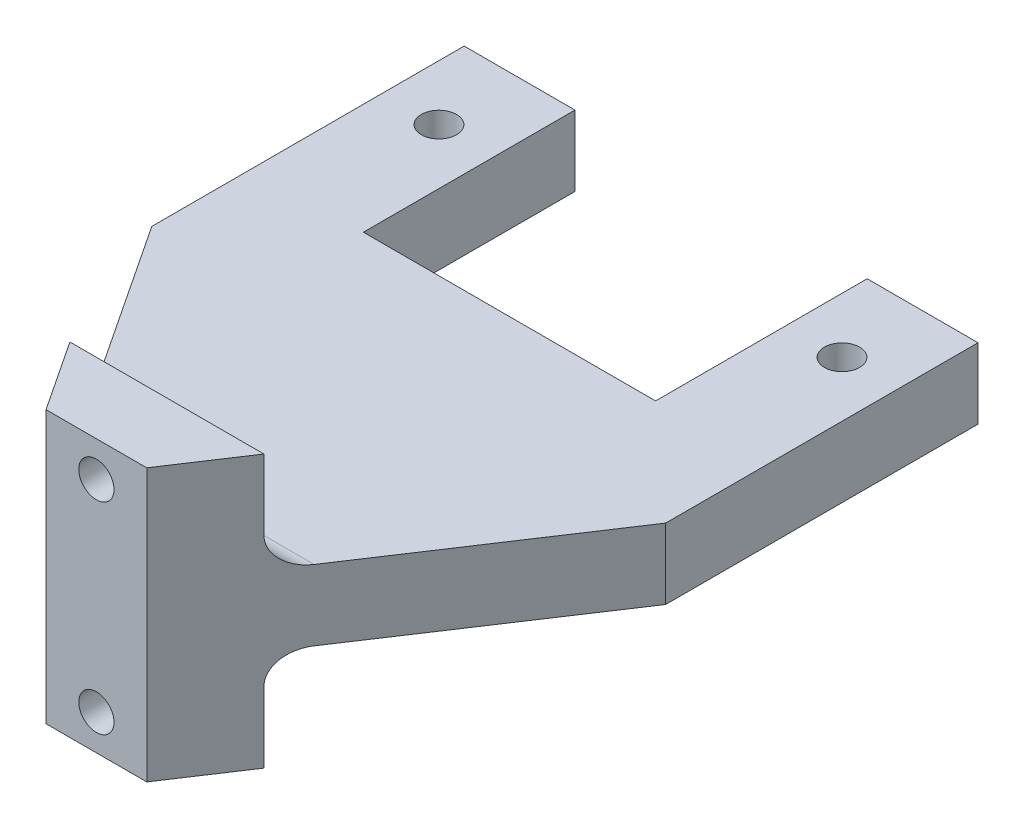
ISO-10303-21;
HEADER;
FILE_DESCRIPTION(('STEP AP214'),'2;1');
FILE_NAME('part.step','',(''),(''),'','','');
FILE_SCHEMA(('AUTOMOTIVE_DESIGN { 1 0 10303 214 1 1 1 1 }'));
ENDSEC;
DATA;
#1=APPLICATION_CONTEXT('core data for automotive mechanical design processes');
#2=APPLICATION_PROTOCOL_DEFINITION('international standard','automotive_design',2000,#1);
#3=PRODUCT_CONTEXT('',#1,'mechanical');
#4=PRODUCT('Part','Part','',(#3));
#5=PRODUCT_RELATED_PRODUCT_CATEGORY('part','',(#4));
#6=PRODUCT_DEFINITION_FORMATION('','',#4);
#7=PRODUCT_DEFINITION_CONTEXT('part definition',#1,'design');
#8=PRODUCT_DEFINITION('design','',#6,#7);
#9=PRODUCT_DEFINITION_SHAPE('','',#8);
#10=(LENGTH_UNIT() NAMED_UNIT(*) SI_UNIT(.MILLI.,.METRE.));
#11=(NAMED_UNIT(*) PLANE_ANGLE_UNIT() SI_UNIT($,.RADIAN.));
#12=(NAMED_UNIT(*) SI_UNIT($,.STERADIAN.) SOLID_ANGLE_UNIT());
#13=UNCERTAINTY_MEASURE_WITH_UNIT(LENGTH_MEASURE(1.E-05),#10,'distance_accuracy_value','');
#14=(GEOMETRIC_REPRESENTATION_CONTEXT(3) GLOBAL_UNCERTAINTY_ASSIGNED_CONTEXT((#13)) GLOBAL_UNIT_ASSIGNED_CONTEXT((#10,
#11,#12)) REPRESENTATION_CONTEXT('',''));
#15=CARTESIAN_POINT('',(0.,0.,0.));
#16=DIRECTION('',(0.,0.,1.));
#17=DIRECTION('',(1.,0.,0.));
#18=AXIS2_PLACEMENT_3D('',#15,#16,#17);
#19=CARTESIAN_POINT('',(0.,0.,0.));
#20=DIRECTION('',(0.,-1.,0.));
#21=DIRECTION('',(0.,0.,-1.));
#22=AXIS2_PLACEMENT_3D('',#19,#20,#21);
#23=PLANE('',#22);
#24=CARTESIAN_POINT('',(5.5,0.,-54.));
#25=DIRECTION('',(0.,1.,0.));
#26=DIRECTION('',(0.,0.,1.));
#27=AXIS2_PLACEMENT_3D('',#24,#25,#26);
#28=CIRCLE('',#27,1.75);
#29=CARTESIAN_POINT('',(5.5,0.,-52.25));
#30=VERTEX_POINT('',#29);
#31=EDGE_CURVE('E238',#30,#30,#28,.T.);
#32=ORIENTED_EDGE('',*,*,#31,.T.);
#33=EDGE_LOOP('',(#32));
#34=FACE_BOUND('',#33,.T.);
#35=CARTESIAN_POINT('',(45.5,0.,-54.));
#36=DIRECTION('',(0.,1.,0.));
#37=DIRECTION('',(0.,0.,1.));
#38=AXIS2_PLACEMENT_3D('',#35,#36,#37);
#39=CIRCLE('',#38,1.75);
#40=CARTESIAN_POINT('',(45.5,0.,-52.25));
#41=VERTEX_POINT('',#40);
#42=EDGE_CURVE('E247',#41,#41,#39,.T.);
#43=ORIENTED_EDGE('',*,*,#42,.T.);
#44=EDGE_LOOP('',(#43));
#45=FACE_BOUND('',#44,.T.);
#46=DIRECTION('',(-0.551591691076976,0.,0.834114264555428));
#47=VECTOR('',#46,1.);
#48=CARTESIAN_POINT('',(30.5,0.,0.));
#49=LINE('',#48,#47);
#50=CARTESIAN_POINT('',(51.,0.,-31.));
#51=VERTEX_POINT('',#50);
#52=CARTESIAN_POINT('',(37.1129032258065,0.,-10.));
#53=VERTEX_POINT('',#52);
#54=EDGE_CURVE('E230',#51,#53,#49,.T.);
#55=ORIENTED_EDGE('',*,*,#54,.T.);
#56=DIRECTION('',(-1.,0.,0.));
#57=VECTOR('',#56,1.);
#58=CARTESIAN_POINT('',(15.8709677419355,0.,-10.));
#59=LINE('',#58,#57);
#60=CARTESIAN_POINT('',(13.8870967741935,0.,-10.));
#61=VERTEX_POINT('',#60);
#62=EDGE_CURVE('E321',#53,#61,#59,.T.);
#63=ORIENTED_EDGE('',*,*,#62,.T.);
#64=DIRECTION('',(-0.551591691076976,0.,-0.834114264555427));
#65=VECTOR('',#64,1.);
#66=CARTESIAN_POINT('',(20.5,0.,0.));
#67=LINE('',#66,#65);
#68=CARTESIAN_POINT('',(0.,0.,-31.));
#69=VERTEX_POINT('',#68);
#70=EDGE_CURVE('E218',#61,#69,#67,.T.);
#71=ORIENTED_EDGE('',*,*,#70,.T.);
#72=DIRECTION('',(0.,0.,1.));
#73=VECTOR('',#72,1.);
#74=CARTESIAN_POINT('',(0.,0.,0.));
#75=LINE('',#74,#73);
#76=CARTESIAN_POINT('',(0.,0.,-62.));
#77=VERTEX_POINT('',#76);
#78=EDGE_CURVE('E280',#77,#69,#75,.T.);
#79=ORIENTED_EDGE('',*,*,#78,.F.);
#80=DIRECTION('',(-1.,0.,0.));
#81=VECTOR('',#80,1.);
#82=CARTESIAN_POINT('',(0.,0.,-62.));
#83=LINE('',#82,#81);
#84=CARTESIAN_POINT('',(11.,0.,-62.));
#85=VERTEX_POINT('',#84);
#86=EDGE_CURVE('E310',#85,#77,#83,.T.);
#87=ORIENTED_EDGE('',*,*,#86,.F.);
#88=DIRECTION('',(0.,0.,1.));
#89=VECTOR('',#88,1.);
#90=CARTESIAN_POINT('',(11.,0.,-62.));
#91=LINE('',#90,#89);
#92=CARTESIAN_POINT('',(11.,0.,-41.));
#93=VERTEX_POINT('',#92);
#94=EDGE_CURVE('E263',#85,#93,#91,.T.);
#95=ORIENTED_EDGE('',*,*,#94,.T.);
#96=DIRECTION('',(1.,0.,0.));
#97=VECTOR('',#96,1.);
#98=CARTESIAN_POINT('',(11.,0.,-41.));
#99=LINE('',#98,#97);
#100=CARTESIAN_POINT('',(40.,0.,-41.));
#101=VERTEX_POINT('',#100);
#102=EDGE_CURVE('E254',#93,#101,#99,.T.);
#103=ORIENTED_EDGE('',*,*,#102,.T.);
#104=DIRECTION('',(0.,0.,-1.));
#105=VECTOR('',#104,1.);
#106=CARTESIAN_POINT('',(40.,0.,-62.));
#107=LINE('',#106,#105);
#108=CARTESIAN_POINT('',(40.,0.,-62.));
#109=VERTEX_POINT('',#108);
#110=EDGE_CURVE('E258',#101,#109,#107,.T.);
#111=ORIENTED_EDGE('',*,*,#110,.T.);
#112=CARTESIAN_POINT('',(51.,0.,-62.));
#113=VERTEX_POINT('',#112);
#114=EDGE_CURVE('E295',#113,#109,#83,.T.);
#115=ORIENTED_EDGE('',*,*,#114,.F.);
#116=DIRECTION('',(0.,0.,-1.));
#117=VECTOR('',#116,1.);
#118=CARTESIAN_POINT('',(51.,0.,0.));
#119=LINE('',#118,#117);
#120=EDGE_CURVE('E307',#51,#113,#119,.T.);
#121=ORIENTED_EDGE('',*,*,#120,.F.);
#122=EDGE_LOOP('',(#55,#63,#71,#79,#87,#95,#103,#111,#115,#121));
#123=FACE_BOUND('',#122,.T.);
#124=ADVANCED_FACE('F39',(#34,#45,#123),#23,.T.);
#125=CARTESIAN_POINT('',(0.,7.,0.));
#126=DIRECTION('',(0.,-1.,0.));
#127=DIRECTION('',(0.,0.,-1.));
#128=AXIS2_PLACEMENT_3D('',#125,#126,#127);
#129=PLANE('',#128);
#130=CARTESIAN_POINT('',(45.5,7.,-54.));
#131=DIRECTION('',(0.,1.,0.));
#132=DIRECTION('',(0.,0.,1.));
#133=AXIS2_PLACEMENT_3D('',#130,#131,#132);
#134=CIRCLE('',#133,1.75);
#135=CARTESIAN_POINT('',(45.5,7.,-52.25));
#136=VERTEX_POINT('',#135);
#137=EDGE_CURVE('E227',#136,#136,#134,.T.);
#138=ORIENTED_EDGE('',*,*,#137,.F.);
#139=EDGE_LOOP('',(#138));
#140=FACE_BOUND('',#139,.T.);
#141=CARTESIAN_POINT('',(5.5,7.,-54.));
#142=DIRECTION('',(0.,1.,0.));
#143=DIRECTION('',(0.,0.,1.));
#144=AXIS2_PLACEMENT_3D('',#141,#142,#143);
#145=CIRCLE('',#144,1.75);
#146=CARTESIAN_POINT('',(5.5,7.,-52.25));
#147=VERTEX_POINT('',#146);
#148=EDGE_CURVE('E243',#147,#147,#145,.T.);
#149=ORIENTED_EDGE('',*,*,#148,.F.);
#150=EDGE_LOOP('',(#149));
#151=FACE_BOUND('',#150,.T.);
#152=DIRECTION('',(-0.551591691076976,0.,-0.834114264555427));
#153=VECTOR('',#152,1.);
#154=CARTESIAN_POINT('',(20.5,7.,0.));
#155=LINE('',#154,#153);
#156=CARTESIAN_POINT('',(13.8870967741935,7.,-10.));
#157=VERTEX_POINT('',#156);
#158=CARTESIAN_POINT('',(0.,7.,-31.));
#159=VERTEX_POINT('',#158);
#160=EDGE_CURVE('E166',#157,#159,#155,.T.);
#161=ORIENTED_EDGE('',*,*,#160,.F.);
#162=DIRECTION('',(-1.,0.,0.));
#163=VECTOR('',#162,1.);
#164=CARTESIAN_POINT('',(35.1290322580645,7.,-10.));
#165=LINE('',#164,#163);
#166=CARTESIAN_POINT('',(37.1129032258065,7.,-10.));
#167=VERTEX_POINT('',#166);
#168=EDGE_CURVE('E61',#157,#167,#165,.F.);
#169=ORIENTED_EDGE('',*,*,#168,.T.);
#170=DIRECTION('',(-0.551591691076976,0.,0.834114264555428));
#171=VECTOR('',#170,1.);
#172=CARTESIAN_POINT('',(30.5,7.,0.));
#173=LINE('',#172,#171);
#174=CARTESIAN_POINT('',(51.,7.,-31.));
#175=VERTEX_POINT('',#174);
#176=EDGE_CURVE('E217',#175,#167,#173,.T.);
#177=ORIENTED_EDGE('',*,*,#176,.F.);
#178=DIRECTION('',(0.,0.,-1.));
#179=VECTOR('',#178,1.);
#180=CARTESIAN_POINT('',(51.,7.,0.));
#181=LINE('',#180,#179);
#182=CARTESIAN_POINT('',(51.,7.,-62.));
#183=VERTEX_POINT('',#182);
#184=EDGE_CURVE('E294',#175,#183,#181,.T.);
#185=ORIENTED_EDGE('',*,*,#184,.T.);
#186=DIRECTION('',(-1.,0.,0.));
#187=VECTOR('',#186,1.);
#188=CARTESIAN_POINT('',(0.,7.,-62.));
#189=LINE('',#188,#187);
#190=CARTESIAN_POINT('',(40.,7.,-62.));
#191=VERTEX_POINT('',#190);
#192=EDGE_CURVE('E299',#183,#191,#189,.T.);
#193=ORIENTED_EDGE('',*,*,#192,.T.);
#194=DIRECTION('',(0.,0.,-1.));
#195=VECTOR('',#194,1.);
#196=CARTESIAN_POINT('',(40.,7.,-62.));
#197=LINE('',#196,#195);
#198=CARTESIAN_POINT('',(40.,7.,-41.));
#199=VERTEX_POINT('',#198);
#200=EDGE_CURVE('E271',#199,#191,#197,.T.);
#201=ORIENTED_EDGE('',*,*,#200,.F.);
#202=DIRECTION('',(1.,0.,0.));
#203=VECTOR('',#202,1.);
#204=CARTESIAN_POINT('',(11.,7.,-41.));
#205=LINE('',#204,#203);
#206=CARTESIAN_POINT('',(11.,7.,-41.));
#207=VERTEX_POINT('',#206);
#208=EDGE_CURVE('E242',#207,#199,#205,.T.);
#209=ORIENTED_EDGE('',*,*,#208,.F.);
#210=DIRECTION('',(0.,0.,1.));
#211=VECTOR('',#210,1.);
#212=CARTESIAN_POINT('',(11.,7.,-62.));
#213=LINE('',#212,#211);
#214=CARTESIAN_POINT('',(11.,7.,-62.));
#215=VERTEX_POINT('',#214);
#216=EDGE_CURVE('E259',#215,#207,#213,.T.);
#217=ORIENTED_EDGE('',*,*,#216,.F.);
#218=CARTESIAN_POINT('',(0.,7.,-62.));
#219=VERTEX_POINT('',#218);
#220=EDGE_CURVE('E298',#215,#219,#189,.T.);
#221=ORIENTED_EDGE('',*,*,#220,.T.);
#222=DIRECTION('',(0.,0.,1.));
#223=VECTOR('',#222,1.);
#224=CARTESIAN_POINT('',(0.,7.,0.));
#225=LINE('',#224,#223);
#226=EDGE_CURVE('E290',#219,#159,#225,.T.);
#227=ORIENTED_EDGE('',*,*,#226,.T.);
#228=EDGE_LOOP('',(#161,#169,#177,#185,#193,#201,#209,#217,#221,#227));
#229=FACE_BOUND('',#228,.T.);
#230=ADVANCED_FACE('F365',(#140,#151,#229),#129,.F.);
#231=CARTESIAN_POINT('',(0.,7.,-62.));
#232=DIRECTION('',(0.,0.,1.));
#233=DIRECTION('',(1.,0.,0.));
#234=AXIS2_PLACEMENT_3D('',#231,#232,#233);
#235=PLANE('',#234);
#236=ORIENTED_EDGE('',*,*,#220,.F.);
#237=DIRECTION('',(0.,1.,0.));
#238=VECTOR('',#237,1.);
#239=CARTESIAN_POINT('',(11.,0.,-62.));
#240=LINE('',#239,#238);
#241=EDGE_CURVE('E281',#85,#215,#240,.T.);
#242=ORIENTED_EDGE('',*,*,#241,.F.);
#243=ORIENTED_EDGE('',*,*,#86,.T.);
#244=DIRECTION('',(0.,-1.,0.));
#245=VECTOR('',#244,1.);
#246=CARTESIAN_POINT('',(0.,7.,-62.));
#247=LINE('',#246,#245);
#248=EDGE_CURVE('E303',#219,#77,#247,.T.);
#249=ORIENTED_EDGE('',*,*,#248,.F.);
#250=EDGE_LOOP('',(#236,#242,#243,#249));
#251=FACE_BOUND('',#250,.T.);
#252=ADVANCED_FACE('F355',(#251),#235,.F.);
#253=CARTESIAN_POINT('',(0.,7.,0.));
#254=DIRECTION('',(1.,0.,0.));
#255=DIRECTION('',(0.,0.,-1.));
#256=AXIS2_PLACEMENT_3D('',#253,#254,#255);
#257=PLANE('',#256);
#258=ORIENTED_EDGE('',*,*,#78,.T.);
#259=DIRECTION('',(0.,1.,0.));
#260=VECTOR('',#259,1.);
#261=CARTESIAN_POINT('',(0.,0.,-31.));
#262=LINE('',#261,#260);
#263=EDGE_CURVE('E223',#69,#159,#262,.T.);
#264=ORIENTED_EDGE('',*,*,#263,.T.);
#265=ORIENTED_EDGE('',*,*,#226,.F.);
#266=ORIENTED_EDGE('',*,*,#248,.T.);
#267=EDGE_LOOP('',(#258,#264,#265,#266));
#268=FACE_BOUND('',#267,.T.);
#269=ADVANCED_FACE('F360',(#268),#257,.F.);
#270=CARTESIAN_POINT('',(0.,7.,0.));
#271=DIRECTION('',(0.,0.,-1.));
#272=DIRECTION('',(-1.,0.,0.));
#273=AXIS2_PLACEMENT_3D('',#270,#271,#272);
#274=PLANE('',#273);
#275=CARTESIAN_POINT('',(25.5,13.5,0.));
#276=DIRECTION('',(0.,0.,1.));
#277=DIRECTION('',(1.,0.,0.));
#278=AXIS2_PLACEMENT_3D('',#275,#276,#277);
#279=CIRCLE('',#278,1.75);
#280=CARTESIAN_POINT('',(27.25,13.5,0.));
#281=VERTEX_POINT('',#280);
#282=EDGE_CURVE('E326',#281,#281,#279,.T.);
#283=ORIENTED_EDGE('',*,*,#282,.F.);
#284=EDGE_LOOP('',(#283));
#285=FACE_BOUND('',#284,.T.);
#286=CARTESIAN_POINT('',(25.5,-6.5,0.));
#287=DIRECTION('',(0.,0.,1.));
#288=DIRECTION('',(1.,0.,0.));
#289=AXIS2_PLACEMENT_3D('',#286,#287,#288);
#290=CIRCLE('',#289,1.75);
#291=CARTESIAN_POINT('',(27.25,-6.5,0.));
#292=VERTEX_POINT('',#291);
#293=EDGE_CURVE('E620',#292,#292,#290,.T.);
#294=ORIENTED_EDGE('',*,*,#293,.F.);
#295=EDGE_LOOP('',(#294));
#296=FACE_BOUND('',#295,.T.);
#297=DIRECTION('',(0.,1.,0.));
#298=VECTOR('',#297,1.);
#299=CARTESIAN_POINT('',(30.5,0.,0.));
#300=LINE('',#299,#298);
#301=CARTESIAN_POINT('',(30.5,-10.,0.));
#302=VERTEX_POINT('',#301);
#303=CARTESIAN_POINT('',(30.5,17.,0.));
#304=VERTEX_POINT('',#303);
#305=EDGE_CURVE('E152',#302,#304,#300,.T.);
#306=ORIENTED_EDGE('',*,*,#305,.T.);
#307=DIRECTION('',(1.,0.,0.));
#308=VECTOR('',#307,1.);
#309=CARTESIAN_POINT('',(30.5,17.,0.));
#310=LINE('',#309,#308);
#311=CARTESIAN_POINT('',(20.5,17.,0.));
#312=VERTEX_POINT('',#311);
#313=EDGE_CURVE('E207',#312,#304,#310,.T.);
#314=ORIENTED_EDGE('',*,*,#313,.F.);
#315=DIRECTION('',(0.,1.,0.));
#316=VECTOR('',#315,1.);
#317=CARTESIAN_POINT('',(20.5,0.,0.));
#318=LINE('',#317,#316);
#319=CARTESIAN_POINT('',(20.5,-10.,0.));
#320=VERTEX_POINT('',#319);
#321=EDGE_CURVE('E181',#320,#312,#318,.T.);
#322=ORIENTED_EDGE('',*,*,#321,.F.);
#323=DIRECTION('',(1.,0.,0.));
#324=VECTOR('',#323,1.);
#325=CARTESIAN_POINT('',(30.5,-10.,0.));
#326=LINE('',#325,#324);
#327=EDGE_CURVE('E173',#320,#302,#326,.T.);
#328=ORIENTED_EDGE('',*,*,#327,.T.);
#329=EDGE_LOOP('',(#306,#314,#322,#328));
#330=FACE_BOUND('',#329,.T.);
#331=ADVANCED_FACE('F180',(#285,#296,#330),#274,.F.);
#332=CARTESIAN_POINT('',(51.,7.,0.));
#333=DIRECTION('',(-1.,0.,0.));
#334=DIRECTION('',(0.,0.,1.));
#335=AXIS2_PLACEMENT_3D('',#332,#333,#334);
#336=PLANE('',#335);
#337=ORIENTED_EDGE('',*,*,#184,.F.);
#338=DIRECTION('',(0.,1.,0.));
#339=VECTOR('',#338,1.);
#340=CARTESIAN_POINT('',(51.,0.,-31.));
#341=LINE('',#340,#339);
#342=EDGE_CURVE('E167',#51,#175,#341,.T.);
#343=ORIENTED_EDGE('',*,*,#342,.F.);
#344=ORIENTED_EDGE('',*,*,#120,.T.);
#345=DIRECTION('',(0.,-1.,0.));
#346=VECTOR('',#345,1.);
#347=CARTESIAN_POINT('',(51.,7.,-62.));
#348=LINE('',#347,#346);
#349=EDGE_CURVE('E317',#183,#113,#348,.T.);
#350=ORIENTED_EDGE('',*,*,#349,.F.);
#351=EDGE_LOOP('',(#337,#343,#344,#350));
#352=FACE_BOUND('',#351,.T.);
#353=ADVANCED_FACE('F385',(#352),#336,.F.);
#354=ORIENTED_EDGE('',*,*,#114,.T.);
#355=DIRECTION('',(0.,1.,0.));
#356=VECTOR('',#355,1.);
#357=CARTESIAN_POINT('',(40.,0.,-62.));
#358=LINE('',#357,#356);
#359=EDGE_CURVE('E284',#109,#191,#358,.T.);
#360=ORIENTED_EDGE('',*,*,#359,.T.);
#361=ORIENTED_EDGE('',*,*,#192,.F.);
#362=ORIENTED_EDGE('',*,*,#349,.T.);
#363=EDGE_LOOP('',(#354,#360,#361,#362));
#364=FACE_BOUND('',#363,.T.);
#365=ADVANCED_FACE('F380',(#364),#235,.F.);
#366=CARTESIAN_POINT('',(11.,0.,-41.));
#367=DIRECTION('',(0.,0.,1.));
#368=DIRECTION('',(1.,0.,0.));
#369=AXIS2_PLACEMENT_3D('',#366,#367,#368);
#370=PLANE('',#369);
#371=ORIENTED_EDGE('',*,*,#208,.T.);
#372=DIRECTION('',(0.,1.,0.));
#373=VECTOR('',#372,1.);
#374=CARTESIAN_POINT('',(40.,0.,-41.));
#375=LINE('',#374,#373);
#376=EDGE_CURVE('E267',#101,#199,#375,.T.);
#377=ORIENTED_EDGE('',*,*,#376,.F.);
#378=ORIENTED_EDGE('',*,*,#102,.F.);
#379=DIRECTION('',(0.,1.,0.));
#380=VECTOR('',#379,1.);
#381=CARTESIAN_POINT('',(11.,0.,-41.));
#382=LINE('',#381,#380);
#383=EDGE_CURVE('E277',#93,#207,#382,.T.);
#384=ORIENTED_EDGE('',*,*,#383,.T.);
#385=EDGE_LOOP('',(#371,#377,#378,#384));
#386=FACE_BOUND('',#385,.T.);
#387=ADVANCED_FACE('F375',(#386),#370,.F.);
#388=CARTESIAN_POINT('',(11.,0.,-62.));
#389=DIRECTION('',(-1.,0.,0.));
#390=DIRECTION('',(0.,0.,1.));
#391=AXIS2_PLACEMENT_3D('',#388,#389,#390);
#392=PLANE('',#391);
#393=ORIENTED_EDGE('',*,*,#216,.T.);
#394=ORIENTED_EDGE('',*,*,#383,.F.);
#395=ORIENTED_EDGE('',*,*,#94,.F.);
#396=ORIENTED_EDGE('',*,*,#241,.T.);
#397=EDGE_LOOP('',(#393,#394,#395,#396));
#398=FACE_BOUND('',#397,.T.);
#399=ADVANCED_FACE('F370',(#398),#392,.F.);
#400=CARTESIAN_POINT('',(40.,0.,-62.));
#401=DIRECTION('',(1.,0.,0.));
#402=DIRECTION('',(0.,0.,-1.));
#403=AXIS2_PLACEMENT_3D('',#400,#401,#402);
#404=PLANE('',#403);
#405=ORIENTED_EDGE('',*,*,#200,.T.);
#406=ORIENTED_EDGE('',*,*,#359,.F.);
#407=ORIENTED_EDGE('',*,*,#110,.F.);
#408=ORIENTED_EDGE('',*,*,#376,.T.);
#409=EDGE_LOOP('',(#405,#406,#407,#408));
#410=FACE_BOUND('',#409,.T.);
#411=ADVANCED_FACE('F377',(#410),#404,.F.);
#412=CARTESIAN_POINT('',(45.5,0.,-54.));
#413=DIRECTION('',(0.,1.,0.));
#414=DIRECTION('',(0.,0.,1.));
#415=AXIS2_PLACEMENT_3D('',#412,#413,#414);
#416=CYLINDRICAL_SURFACE('',#415,1.75);
#417=ORIENTED_EDGE('',*,*,#42,.F.);
#418=EDGE_LOOP('',(#417));
#419=FACE_BOUND('',#418,.T.);
#420=ORIENTED_EDGE('',*,*,#137,.T.);
#421=EDGE_LOOP('',(#420));
#422=FACE_BOUND('',#421,.T.);
#423=ADVANCED_FACE('F462',(#419,#422),#416,.F.);
#424=CARTESIAN_POINT('',(5.5,0.,-54.));
#425=DIRECTION('',(0.,1.,0.));
#426=DIRECTION('',(0.,0.,1.));
#427=AXIS2_PLACEMENT_3D('',#424,#425,#426);
#428=CYLINDRICAL_SURFACE('',#427,1.75);
#429=ORIENTED_EDGE('',*,*,#31,.F.);
#430=EDGE_LOOP('',(#429));
#431=FACE_BOUND('',#430,.T.);
#432=ORIENTED_EDGE('',*,*,#148,.T.);
#433=EDGE_LOOP('',(#432));
#434=FACE_BOUND('',#433,.T.);
#435=ADVANCED_FACE('F459',(#431,#434),#428,.F.);
#436=CARTESIAN_POINT('',(30.5,0.,0.));
#437=DIRECTION('',(-0.834114264555428,0.,-0.551591691076976));
#438=DIRECTION('',(-0.551591691076976,0.,0.834114264555428));
#439=AXIS2_PLACEMENT_3D('',#436,#437,#438);
#440=PLANE('',#439);
#441=ORIENTED_EDGE('',*,*,#176,.T.);
#442=CARTESIAN_POINT('',(37.1129032258065,10.,-10.));
#443=DIRECTION('',(-0.834114264555428,0.,-0.551591691076976));
#444=DIRECTION('',(0.551591691076976,0.,-0.834114264555428));
#445=AXIS2_PLACEMENT_3D('',#442,#443,#444);
#446=ELLIPSE('',#445,3.59662953564157,3.);
#447=CARTESIAN_POINT('',(35.1290322580645,10.,-7.));
#448=VERTEX_POINT('',#447);
#449=EDGE_CURVE('E11',#167,#448,#446,.T.);
#450=ORIENTED_EDGE('',*,*,#449,.T.);
#451=DIRECTION('',(0.,-1.,0.));
#452=VECTOR('',#451,1.);
#453=CARTESIAN_POINT('',(35.1290322580645,17.,-7.));
#454=LINE('',#453,#452);
#455=CARTESIAN_POINT('',(35.1290322580645,17.,-7.));
#456=VERTEX_POINT('',#455);
#457=EDGE_CURVE('E213',#456,#448,#454,.T.);
#458=ORIENTED_EDGE('',*,*,#457,.F.);
#459=DIRECTION('',(0.551591691076976,0.,-0.834114264555428));
#460=VECTOR('',#459,1.);
#461=CARTESIAN_POINT('',(35.1290322580645,17.,-7.));
#462=LINE('',#461,#460);
#463=EDGE_CURVE('E160',#304,#456,#462,.T.);
#464=ORIENTED_EDGE('',*,*,#463,.F.);
#465=ORIENTED_EDGE('',*,*,#305,.F.);
#466=DIRECTION('',(0.551591691076976,0.,-0.834114264555428));
#467=VECTOR('',#466,1.);
#468=CARTESIAN_POINT('',(35.1290322580645,-10.,-7.));
#469=LINE('',#468,#467);
#470=CARTESIAN_POINT('',(35.1290322580645,-10.,-7.));
#471=VERTEX_POINT('',#470);
#472=EDGE_CURVE('E156',#302,#471,#469,.T.);
#473=ORIENTED_EDGE('',*,*,#472,.T.);
#474=DIRECTION('',(0.,1.,0.));
#475=VECTOR('',#474,1.);
#476=CARTESIAN_POINT('',(35.1290322580645,-10.,-7.));
#477=LINE('',#476,#475);
#478=CARTESIAN_POINT('',(35.1290322580645,-3.,-7.));
#479=VERTEX_POINT('',#478);
#480=EDGE_CURVE('E191',#471,#479,#477,.T.);
#481=ORIENTED_EDGE('',*,*,#480,.T.);
#482=CARTESIAN_POINT('',(37.1129032258065,-3.,-10.));
#483=DIRECTION('',(-0.834114264555428,0.,-0.551591691076976));
#484=DIRECTION('',(0.551591691076976,0.,-0.834114264555428));
#485=AXIS2_PLACEMENT_3D('',#482,#483,#484);
#486=ELLIPSE('',#485,3.59662953564157,3.);
#487=EDGE_CURVE('E345',#479,#53,#486,.T.);
#488=ORIENTED_EDGE('',*,*,#487,.T.);
#489=ORIENTED_EDGE('',*,*,#54,.F.);
#490=ORIENTED_EDGE('',*,*,#342,.T.);
#491=EDGE_LOOP('',(#441,#450,#458,#464,#465,#473,#481,#488,#489,#490));
#492=FACE_BOUND('',#491,.T.);
#493=ADVANCED_FACE('F154',(#492),#440,.F.);
#494=CARTESIAN_POINT('',(20.5,0.,0.));
#495=DIRECTION('',(0.834114264555427,0.,-0.551591691076976));
#496=DIRECTION('',(-0.551591691076976,0.,-0.834114264555427));
#497=AXIS2_PLACEMENT_3D('',#494,#495,#496);
#498=PLANE('',#497);
#499=ORIENTED_EDGE('',*,*,#321,.T.);
#500=DIRECTION('',(0.551591691076976,0.,0.834114264555427));
#501=VECTOR('',#500,1.);
#502=CARTESIAN_POINT('',(20.5,17.,0.));
#503=LINE('',#502,#501);
#504=CARTESIAN_POINT('',(15.8709677419355,17.,-7.));
#505=VERTEX_POINT('',#504);
#506=EDGE_CURVE('E203',#505,#312,#503,.T.);
#507=ORIENTED_EDGE('',*,*,#506,.F.);
#508=DIRECTION('',(0.,-1.,0.));
#509=VECTOR('',#508,1.);
#510=CARTESIAN_POINT('',(15.8709677419355,17.,-7.));
#511=LINE('',#510,#509);
#512=CARTESIAN_POINT('',(15.8709677419355,10.,-7.));
#513=VERTEX_POINT('',#512);
#514=EDGE_CURVE('E210',#505,#513,#511,.T.);
#515=ORIENTED_EDGE('',*,*,#514,.T.);
#516=CARTESIAN_POINT('',(13.8870967741935,10.,-10.));
#517=DIRECTION('',(0.834114264555427,0.,-0.551591691076976));
#518=DIRECTION('',(0.551591691076976,0.,0.834114264555427));
#519=AXIS2_PLACEMENT_3D('',#516,#517,#518);
#520=ELLIPSE('',#519,3.59662953564157,3.);
#521=EDGE_CURVE('E48',#513,#157,#520,.T.);
#522=ORIENTED_EDGE('',*,*,#521,.T.);
#523=ORIENTED_EDGE('',*,*,#160,.T.);
#524=ORIENTED_EDGE('',*,*,#263,.F.);
#525=ORIENTED_EDGE('',*,*,#70,.F.);
#526=CARTESIAN_POINT('',(13.8870967741935,-3.,-10.));
#527=DIRECTION('',(0.834114264555427,0.,-0.551591691076976));
#528=DIRECTION('',(0.551591691076976,0.,0.834114264555427));
#529=AXIS2_PLACEMENT_3D('',#526,#527,#528);
#530=ELLIPSE('',#529,3.59662953564157,3.);
#531=CARTESIAN_POINT('',(15.8709677419355,-3.,-7.));
#532=VERTEX_POINT('',#531);
#533=EDGE_CURVE('E342',#61,#532,#530,.T.);
#534=ORIENTED_EDGE('',*,*,#533,.T.);
#535=DIRECTION('',(0.,1.,0.));
#536=VECTOR('',#535,1.);
#537=CARTESIAN_POINT('',(15.8709677419355,-10.,-7.));
#538=LINE('',#537,#536);
#539=CARTESIAN_POINT('',(15.8709677419355,-10.,-7.));
#540=VERTEX_POINT('',#539);
#541=EDGE_CURVE('E194',#540,#532,#538,.T.);
#542=ORIENTED_EDGE('',*,*,#541,.F.);
#543=DIRECTION('',(0.551591691076976,0.,0.834114264555427));
#544=VECTOR('',#543,1.);
#545=CARTESIAN_POINT('',(20.5,-10.,0.));
#546=LINE('',#545,#544);
#547=EDGE_CURVE('E183',#540,#320,#546,.T.);
#548=ORIENTED_EDGE('',*,*,#547,.T.);
#549=EDGE_LOOP('',(#499,#507,#515,#522,#523,#524,#525,#534,#542,#548));
#550=FACE_BOUND('',#549,.T.);
#551=ADVANCED_FACE('F364',(#550),#498,.F.);
#552=CARTESIAN_POINT('',(15.8709677419355,17.,-7.));
#553=DIRECTION('',(0.,0.,1.));
#554=DIRECTION('',(1.,0.,0.));
#555=AXIS2_PLACEMENT_3D('',#552,#553,#554);
#556=PLANE('',#555);
#557=CARTESIAN_POINT('',(25.5,13.5,-7.));
#558=DIRECTION('',(0.,0.,1.));
#559=DIRECTION('',(1.,0.,0.));
#560=AXIS2_PLACEMENT_3D('',#557,#558,#559);
#561=CIRCLE('',#560,1.75);
#562=CARTESIAN_POINT('',(27.25,13.5,-7.));
#563=VERTEX_POINT('',#562);
#564=EDGE_CURVE('E178',#563,#563,#561,.T.);
#565=ORIENTED_EDGE('',*,*,#564,.T.);
#566=EDGE_LOOP('',(#565));
#567=FACE_BOUND('',#566,.T.);
#568=ORIENTED_EDGE('',*,*,#457,.T.);
#569=DIRECTION('',(-1.,0.,0.));
#570=VECTOR('',#569,1.);
#571=CARTESIAN_POINT('',(15.8709677419355,10.,-7.));
#572=LINE('',#571,#570);
#573=EDGE_CURVE('E336',#448,#513,#572,.T.);
#574=ORIENTED_EDGE('',*,*,#573,.T.);
#575=ORIENTED_EDGE('',*,*,#514,.F.);
#576=DIRECTION('',(-1.,0.,0.));
#577=VECTOR('',#576,1.);
#578=CARTESIAN_POINT('',(15.8709677419355,17.,-7.));
#579=LINE('',#578,#577);
#580=EDGE_CURVE('E200',#456,#505,#579,.T.);
#581=ORIENTED_EDGE('',*,*,#580,.F.);
#582=EDGE_LOOP('',(#568,#574,#575,#581));
#583=FACE_BOUND('',#582,.T.);
#584=ADVANCED_FACE('F403',(#567,#583),#556,.F.);
#585=CARTESIAN_POINT('',(0.,17.,0.));
#586=DIRECTION('',(0.,-1.,0.));
#587=DIRECTION('',(0.,0.,-1.));
#588=AXIS2_PLACEMENT_3D('',#585,#586,#587);
#589=PLANE('',#588);
#590=ORIENTED_EDGE('',*,*,#463,.T.);
#591=ORIENTED_EDGE('',*,*,#580,.T.);
#592=ORIENTED_EDGE('',*,*,#506,.T.);
#593=ORIENTED_EDGE('',*,*,#313,.T.);
#594=EDGE_LOOP('',(#590,#591,#592,#593));
#595=FACE_BOUND('',#594,.T.);
#596=ADVANCED_FACE('F394',(#595),#589,.F.);
#597=CARTESIAN_POINT('',(15.8709677419355,-10.,-7.));
#598=DIRECTION('',(0.,0.,-1.));
#599=DIRECTION('',(-1.,0.,0.));
#600=AXIS2_PLACEMENT_3D('',#597,#598,#599);
#601=PLANE('',#600);
#602=CARTESIAN_POINT('',(25.5,-6.5,-7.));
#603=DIRECTION('',(0.,0.,-1.));
#604=DIRECTION('',(-1.,0.,0.));
#605=AXIS2_PLACEMENT_3D('',#602,#603,#604);
#606=CIRCLE('',#605,1.75);
#607=CARTESIAN_POINT('',(23.75,-6.5,-7.));
#608=VERTEX_POINT('',#607);
#609=EDGE_CURVE('E322',#608,#608,#606,.T.);
#610=ORIENTED_EDGE('',*,*,#609,.F.);
#611=EDGE_LOOP('',(#610));
#612=FACE_BOUND('',#611,.T.);
#613=ORIENTED_EDGE('',*,*,#541,.T.);
#614=DIRECTION('',(-1.,0.,0.));
#615=VECTOR('',#614,1.);
#616=CARTESIAN_POINT('',(35.1290322580645,-3.,-7.));
#617=LINE('',#616,#615);
#618=EDGE_CURVE('E333',#532,#479,#617,.F.);
#619=ORIENTED_EDGE('',*,*,#618,.T.);
#620=ORIENTED_EDGE('',*,*,#480,.F.);
#621=DIRECTION('',(-1.,0.,0.));
#622=VECTOR('',#621,1.);
#623=CARTESIAN_POINT('',(15.8709677419355,-10.,-7.));
#624=LINE('',#623,#622);
#625=EDGE_CURVE('E176',#471,#540,#624,.T.);
#626=ORIENTED_EDGE('',*,*,#625,.T.);
#627=EDGE_LOOP('',(#613,#619,#620,#626));
#628=FACE_BOUND('',#627,.T.);
#629=ADVANCED_FACE('F392',(#612,#628),#601,.T.);
#630=CARTESIAN_POINT('',(0.,-10.,0.));
#631=DIRECTION('',(0.,1.,0.));
#632=DIRECTION('',(0.,0.,-1.));
#633=AXIS2_PLACEMENT_3D('',#630,#631,#632);
#634=PLANE('',#633);
#635=ORIENTED_EDGE('',*,*,#472,.F.);
#636=ORIENTED_EDGE('',*,*,#327,.F.);
#637=ORIENTED_EDGE('',*,*,#547,.F.);
#638=ORIENTED_EDGE('',*,*,#625,.F.);
#639=EDGE_LOOP('',(#635,#636,#637,#638));
#640=FACE_BOUND('',#639,.T.);
#641=ADVANCED_FACE('F171',(#640),#634,.F.);
#642=CARTESIAN_POINT('',(25.5,-6.5,-62.));
#643=DIRECTION('',(0.,0.,1.));
#644=DIRECTION('',(1.,0.,0.));
#645=AXIS2_PLACEMENT_3D('',#642,#643,#644);
#646=CYLINDRICAL_SURFACE('',#645,1.75);
#647=ORIENTED_EDGE('',*,*,#609,.T.);
#648=EDGE_LOOP('',(#647));
#649=FACE_BOUND('',#648,.T.);
#650=ORIENTED_EDGE('',*,*,#293,.T.);
#651=EDGE_LOOP('',(#650));
#652=FACE_BOUND('',#651,.T.);
#653=ADVANCED_FACE('F401',(#649,#652),#646,.F.);
#654=CARTESIAN_POINT('',(25.5,13.5,-62.));
#655=DIRECTION('',(0.,0.,1.));
#656=DIRECTION('',(1.,0.,0.));
#657=AXIS2_PLACEMENT_3D('',#654,#655,#656);
#658=CYLINDRICAL_SURFACE('',#657,1.75);
#659=ORIENTED_EDGE('',*,*,#282,.T.);
#660=EDGE_LOOP('',(#659));
#661=FACE_BOUND('',#660,.T.);
#662=ORIENTED_EDGE('',*,*,#564,.F.);
#663=EDGE_LOOP('',(#662));
#664=FACE_BOUND('',#663,.T.);
#665=ADVANCED_FACE('F427',(#661,#664),#658,.F.);
#666=CARTESIAN_POINT('',(0.,-3.,-10.));
#667=DIRECTION('',(1.,0.,0.));
#668=DIRECTION('',(0.,0.,-1.));
#669=AXIS2_PLACEMENT_3D('',#666,#667,#668);
#670=CYLINDRICAL_SURFACE('',#669,3.);
#671=ORIENTED_EDGE('',*,*,#487,.F.);
#672=ORIENTED_EDGE('',*,*,#618,.F.);
#673=ORIENTED_EDGE('',*,*,#533,.F.);
#674=ORIENTED_EDGE('',*,*,#62,.F.);
#675=EDGE_LOOP('',(#671,#672,#673,#674));
#676=FACE_BOUND('',#675,.T.);
#677=ADVANCED_FACE('F389',(#676),#670,.F.);
#678=CARTESIAN_POINT('',(15.8709677419355,10.,-10.));
#679=DIRECTION('',(1.,0.,0.));
#680=DIRECTION('',(0.,0.,-1.));
#681=AXIS2_PLACEMENT_3D('',#678,#679,#680);
#682=CYLINDRICAL_SURFACE('',#681,3.);
#683=ORIENTED_EDGE('',*,*,#449,.F.);
#684=ORIENTED_EDGE('',*,*,#168,.F.);
#685=ORIENTED_EDGE('',*,*,#521,.F.);
#686=ORIENTED_EDGE('',*,*,#573,.F.);
#687=EDGE_LOOP('',(#683,#684,#685,#686));
#688=FACE_BOUND('',#687,.T.);
#689=ADVANCED_FACE('F41',(#688),#682,.F.);
#690=CLOSED_SHELL('',(#124,#230,#252,#269,#331,#353,#365,#387,#399,#411,#423,#435,#493,#551,
#584,#596,#629,#641,#653,#665,#677,#689));
#691=MANIFOLD_SOLID_BREP('B2',#690);
#692=ADVANCED_BREP_SHAPE_REPRESENTATION('',(#18,#691),#14);
#693=SHAPE_DEFINITION_REPRESENTATION(#9,#692);
ENDSEC;
END-ISO-10303-21;
